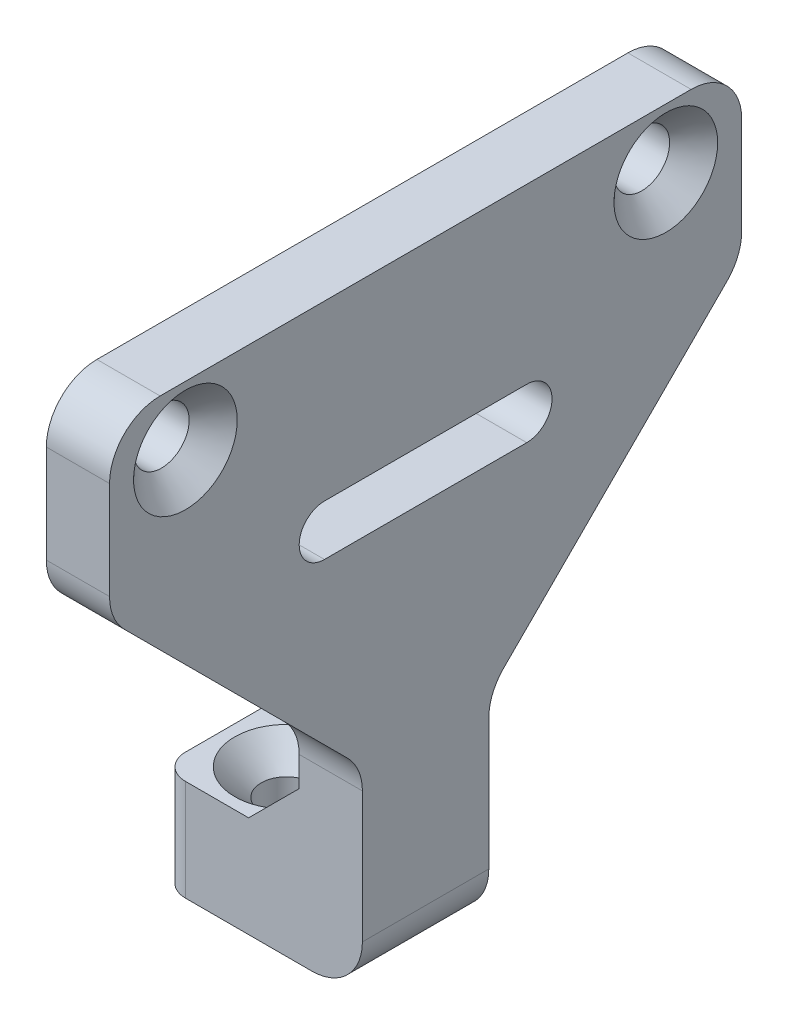
ISO-10303-21;
HEADER;
FILE_DESCRIPTION(('STEP AP214'),'2;1');
FILE_NAME('part.step','',(''),(''),'','','');
FILE_SCHEMA(('AUTOMOTIVE_DESIGN { 1 0 10303 214 1 1 1 1 }'));
ENDSEC;
DATA;
#1=APPLICATION_CONTEXT('core data for automotive mechanical design processes');
#2=APPLICATION_PROTOCOL_DEFINITION('international standard','automotive_design',2000,#1);
#3=PRODUCT_CONTEXT('',#1,'mechanical');
#4=PRODUCT('Part','Part','',(#3));
#5=PRODUCT_RELATED_PRODUCT_CATEGORY('part','',(#4));
#6=PRODUCT_DEFINITION_FORMATION('','',#4);
#7=PRODUCT_DEFINITION_CONTEXT('part definition',#1,'design');
#8=PRODUCT_DEFINITION('design','',#6,#7);
#9=PRODUCT_DEFINITION_SHAPE('','',#8);
#10=(LENGTH_UNIT() NAMED_UNIT(*) SI_UNIT(.MILLI.,.METRE.));
#11=(NAMED_UNIT(*) PLANE_ANGLE_UNIT() SI_UNIT($,.RADIAN.));
#12=(NAMED_UNIT(*) SI_UNIT($,.STERADIAN.) SOLID_ANGLE_UNIT());
#13=UNCERTAINTY_MEASURE_WITH_UNIT(LENGTH_MEASURE(1.E-05),#10,'distance_accuracy_value','');
#14=(GEOMETRIC_REPRESENTATION_CONTEXT(3) GLOBAL_UNCERTAINTY_ASSIGNED_CONTEXT((#13)) GLOBAL_UNIT_ASSIGNED_CONTEXT((#10,
#11,#12)) REPRESENTATION_CONTEXT('',''));
#15=CARTESIAN_POINT('',(0.,0.,0.));
#16=DIRECTION('',(0.,0.,1.));
#17=DIRECTION('',(1.,0.,0.));
#18=AXIS2_PLACEMENT_3D('',#15,#16,#17);
#19=CARTESIAN_POINT('',(0.,-16.35,2.5));
#20=DIRECTION('',(0.707106781186549,-0.707106781186546,0.));
#21=DIRECTION('',(0.707106781186546,0.707106781186549,0.));
#22=AXIS2_PLACEMENT_3D('',#19,#20,#21);
#23=PLANE('',#22);
#24=CARTESIAN_POINT('',(-3.,-19.35,0.));
#25=DIRECTION('',(0.707106781186549,-0.707106781186546,0.));
#26=DIRECTION('',(-0.707106781186546,-0.707106781186549,0.));
#27=AXIS2_PLACEMENT_3D('',#24,#25,#26);
#28=ELLIPSE('',#27,2.89913780286485,2.05);
#29=CARTESIAN_POINT('',(-1.99999999999999,-18.35,1.78955301681732));
#30=VERTEX_POINT('',#29);
#31=CARTESIAN_POINT('',(-1.99999999999999,-18.35,-1.78955301681732));
#32=VERTEX_POINT('',#31);
#33=EDGE_CURVE('E249',#30,#32,#28,.F.);
#34=ORIENTED_EDGE('',*,*,#33,.F.);
#35=DIRECTION('',(0.,0.,-1.));
#36=VECTOR('',#35,1.);
#37=CARTESIAN_POINT('',(-1.99999999999999,-18.35,2.5));
#38=LINE('',#37,#36);
#39=CARTESIAN_POINT('',(-1.99999999999999,-18.35,2.5));
#40=VERTEX_POINT('',#39);
#41=EDGE_CURVE('E285',#40,#30,#38,.T.);
#42=ORIENTED_EDGE('',*,*,#41,.F.);
#43=DIRECTION('',(-0.707106781186546,-0.707106781186549,0.));
#44=VECTOR('',#43,1.);
#45=CARTESIAN_POINT('',(0.,-16.35,2.5));
#46=LINE('',#45,#44);
#47=CARTESIAN_POINT('',(0.,-16.35,2.5));
#48=VERTEX_POINT('',#47);
#49=EDGE_CURVE('E259',#48,#40,#46,.T.);
#50=ORIENTED_EDGE('',*,*,#49,.F.);
#51=DIRECTION('',(0.,0.,-1.));
#52=VECTOR('',#51,1.);
#53=CARTESIAN_POINT('',(0.,-16.35,2.5));
#54=LINE('',#53,#52);
#55=CARTESIAN_POINT('',(0.,-16.35,-2.5));
#56=VERTEX_POINT('',#55);
#57=EDGE_CURVE('E288',#48,#56,#54,.T.);
#58=ORIENTED_EDGE('',*,*,#57,.T.);
#59=DIRECTION('',(-0.707106781186546,-0.707106781186549,0.));
#60=VECTOR('',#59,1.);
#61=CARTESIAN_POINT('',(0.,-16.35,-2.5));
#62=LINE('',#61,#60);
#63=CARTESIAN_POINT('',(-1.99999999999999,-18.35,-2.5));
#64=VERTEX_POINT('',#63);
#65=EDGE_CURVE('E268',#56,#64,#62,.T.);
#66=ORIENTED_EDGE('',*,*,#65,.T.);
#67=EDGE_CURVE('E284',#32,#64,#38,.T.);
#68=ORIENTED_EDGE('',*,*,#67,.F.);
#69=EDGE_LOOP('',(#34,#42,#50,#58,#66,#68));
#70=FACE_BOUND('',#69,.T.);
#71=ADVANCED_FACE('F35',(#70),#23,.F.);
#72=CARTESIAN_POINT('',(-1.99999999999999,-18.35,2.5));
#73=DIRECTION('',(0.,-1.,0.));
#74=DIRECTION('',(0.,0.,-1.));
#75=AXIS2_PLACEMENT_3D('',#72,#73,#74);
#76=PLANE('',#75);
#77=DIRECTION('',(-1.,0.,0.));
#78=VECTOR('',#77,1.);
#79=CARTESIAN_POINT('',(-1.99999999999999,-18.35,-2.5));
#80=LINE('',#79,#78);
#81=CARTESIAN_POINT('',(-4.5,-18.35,-2.5));
#82=VERTEX_POINT('',#81);
#83=EDGE_CURVE('E271',#64,#82,#80,.T.);
#84=ORIENTED_EDGE('',*,*,#83,.T.);
#85=CARTESIAN_POINT('',(-4.5,-18.35,-1.5));
#86=DIRECTION('',(0.,-1.,0.));
#87=DIRECTION('',(0.,0.,-1.));
#88=AXIS2_PLACEMENT_3D('',#85,#86,#87);
#89=CIRCLE('',#88,1.);
#90=CARTESIAN_POINT('',(-5.5,-18.35,-1.5));
#91=VERTEX_POINT('',#90);
#92=EDGE_CURVE('E389',#82,#91,#89,.F.);
#93=ORIENTED_EDGE('',*,*,#92,.T.);
#94=DIRECTION('',(0.,0.,-1.));
#95=VECTOR('',#94,1.);
#96=CARTESIAN_POINT('',(-5.5,-18.35,2.5));
#97=LINE('',#96,#95);
#98=CARTESIAN_POINT('',(-5.5,-18.35,1.5));
#99=VERTEX_POINT('',#98);
#100=EDGE_CURVE('E281',#99,#91,#97,.T.);
#101=ORIENTED_EDGE('',*,*,#100,.F.);
#102=CARTESIAN_POINT('',(-4.5,-18.35,1.5));
#103=DIRECTION('',(0.,-1.,0.));
#104=DIRECTION('',(0.,0.,-1.));
#105=AXIS2_PLACEMENT_3D('',#102,#103,#104);
#106=CIRCLE('',#105,1.);
#107=CARTESIAN_POINT('',(-4.5,-18.35,2.5));
#108=VERTEX_POINT('',#107);
#109=EDGE_CURVE('E387',#99,#108,#106,.F.);
#110=ORIENTED_EDGE('',*,*,#109,.T.);
#111=DIRECTION('',(-1.,0.,0.));
#112=VECTOR('',#111,1.);
#113=CARTESIAN_POINT('',(-1.99999999999999,-18.35,2.5));
#114=LINE('',#113,#112);
#115=EDGE_CURVE('E261',#40,#108,#114,.T.);
#116=ORIENTED_EDGE('',*,*,#115,.F.);
#117=ORIENTED_EDGE('',*,*,#41,.T.);
#118=CARTESIAN_POINT('',(-3.,-18.35,0.));
#119=DIRECTION('',(0.,1.,0.));
#120=DIRECTION('',(0.,0.,1.));
#121=AXIS2_PLACEMENT_3D('',#118,#119,#120);
#122=CIRCLE('',#121,2.05);
#123=EDGE_CURVE('E251',#32,#30,#122,.T.);
#124=ORIENTED_EDGE('',*,*,#123,.F.);
#125=ORIENTED_EDGE('',*,*,#67,.T.);
#126=EDGE_LOOP('',(#84,#93,#101,#110,#116,#117,#124,#125));
#127=FACE_BOUND('',#126,.T.);
#128=ADVANCED_FACE('F511',(#127),#76,.F.);
#129=CARTESIAN_POINT('',(2.5,0.,0.));
#130=DIRECTION('',(1.,0.,0.));
#131=DIRECTION('',(0.,0.,-1.));
#132=AXIS2_PLACEMENT_3D('',#129,#130,#131);
#133=PLANE('',#132);
#134=CARTESIAN_POINT('',(2.5,-5.5,4.));
#135=DIRECTION('',(1.,0.,0.));
#136=DIRECTION('',(0.,0.,-1.));
#137=AXIS2_PLACEMENT_3D('',#134,#135,#136);
#138=CIRCLE('',#137,1.);
#139=CARTESIAN_POINT('',(2.5,-4.5,4.));
#140=VERTEX_POINT('',#139);
#141=CARTESIAN_POINT('',(2.5,-6.5,4.));
#142=VERTEX_POINT('',#141);
#143=EDGE_CURVE('E223',#140,#142,#138,.T.);
#144=ORIENTED_EDGE('',*,*,#143,.F.);
#145=DIRECTION('',(0.,0.,1.));
#146=VECTOR('',#145,1.);
#147=CARTESIAN_POINT('',(2.5,-4.5,4.));
#148=LINE('',#147,#146);
#149=CARTESIAN_POINT('',(2.5,-4.5,-4.));
#150=VERTEX_POINT('',#149);
#151=EDGE_CURVE('E228',#150,#140,#148,.T.);
#152=ORIENTED_EDGE('',*,*,#151,.F.);
#153=CARTESIAN_POINT('',(2.5,-5.5,-4.));
#154=DIRECTION('',(1.,0.,0.));
#155=DIRECTION('',(0.,0.,-1.));
#156=AXIS2_PLACEMENT_3D('',#153,#154,#155);
#157=CIRCLE('',#156,1.);
#158=CARTESIAN_POINT('',(2.5,-6.5,-4.));
#159=VERTEX_POINT('',#158);
#160=EDGE_CURVE('E207',#159,#150,#157,.T.);
#161=ORIENTED_EDGE('',*,*,#160,.F.);
#162=DIRECTION('',(0.,0.,-1.));
#163=VECTOR('',#162,1.);
#164=CARTESIAN_POINT('',(2.5,-6.5,4.));
#165=LINE('',#164,#163);
#166=EDGE_CURVE('E218',#142,#159,#165,.T.);
#167=ORIENTED_EDGE('',*,*,#166,.F.);
#168=EDGE_LOOP('',(#144,#152,#161,#167));
#169=FACE_BOUND('',#168,.T.);
#170=DIRECTION('',(0.,1.,0.));
#171=VECTOR('',#170,1.);
#172=CARTESIAN_POINT('',(2.5,-2.35,2.5));
#173=LINE('',#172,#171);
#174=CARTESIAN_POINT('',(2.5,-20.35,2.5));
#175=VERTEX_POINT('',#174);
#176=CARTESIAN_POINT('',(2.5,-15.1784271247463,2.5));
#177=VERTEX_POINT('',#176);
#178=EDGE_CURVE('E267',#175,#177,#173,.T.);
#179=ORIENTED_EDGE('',*,*,#178,.F.);
#180=DIRECTION('',(0.,0.,-1.));
#181=VECTOR('',#180,1.);
#182=CARTESIAN_POINT('',(2.5,-20.35,-2.5));
#183=LINE('',#182,#181);
#184=CARTESIAN_POINT('',(2.5,-20.35,-2.5));
#185=VERTEX_POINT('',#184);
#186=EDGE_CURVE('E394',#175,#185,#183,.T.);
#187=ORIENTED_EDGE('',*,*,#186,.T.);
#188=DIRECTION('',(0.,1.,0.));
#189=VECTOR('',#188,1.);
#190=CARTESIAN_POINT('',(2.5,-2.35,-2.5));
#191=LINE('',#190,#189);
#192=CARTESIAN_POINT('',(2.5,-15.1784271247463,-2.5));
#193=VERTEX_POINT('',#192);
#194=EDGE_CURVE('E277',#185,#193,#191,.T.);
#195=ORIENTED_EDGE('',*,*,#194,.T.);
#196=CARTESIAN_POINT('',(2.5,-15.1784271247463,-4.5));
#197=DIRECTION('',(1.,0.,0.));
#198=DIRECTION('',(0.,0.,-1.));
#199=AXIS2_PLACEMENT_3D('',#196,#197,#198);
#200=CIRCLE('',#199,2.);
#201=CARTESIAN_POINT('',(2.5,-13.7642135623732,-3.0857864376269));
#202=VERTEX_POINT('',#201);
#203=EDGE_CURVE('E367',#193,#202,#200,.F.);
#204=ORIENTED_EDGE('',*,*,#203,.T.);
#205=DIRECTION('',(0.,0.707106781186551,-0.707106781186544));
#206=VECTOR('',#205,1.);
#207=CARTESIAN_POINT('',(2.5,-14.3500000000001,-2.5));
#208=LINE('',#207,#206);
#209=CARTESIAN_POINT('',(2.5,-4.9357864376269,-11.9142135623731));
#210=VERTEX_POINT('',#209);
#211=EDGE_CURVE('E235',#202,#210,#208,.T.);
#212=ORIENTED_EDGE('',*,*,#211,.T.);
#213=CARTESIAN_POINT('',(2.5,-3.52157287525382,-10.5));
#214=DIRECTION('',(1.,0.,0.));
#215=DIRECTION('',(0.,0.,-1.));
#216=AXIS2_PLACEMENT_3D('',#213,#214,#215);
#217=CIRCLE('',#216,2.);
#218=CARTESIAN_POINT('',(2.5,-3.52157287525382,-12.5));
#219=VERTEX_POINT('',#218);
#220=EDGE_CURVE('E422',#210,#219,#217,.T.);
#221=ORIENTED_EDGE('',*,*,#220,.T.);
#222=DIRECTION('',(0.,1.,0.));
#223=VECTOR('',#222,1.);
#224=CARTESIAN_POINT('',(2.5,2.35,-12.5));
#225=LINE('',#224,#223);
#226=CARTESIAN_POINT('',(2.5,0.35,-12.5));
#227=VERTEX_POINT('',#226);
#228=EDGE_CURVE('E309',#219,#227,#225,.T.);
#229=ORIENTED_EDGE('',*,*,#228,.T.);
#230=CARTESIAN_POINT('',(2.5,0.35,-10.5));
#231=DIRECTION('',(1.,0.,0.));
#232=DIRECTION('',(0.,0.,-1.));
#233=AXIS2_PLACEMENT_3D('',#230,#231,#232);
#234=CIRCLE('',#233,2.);
#235=CARTESIAN_POINT('',(2.5,2.35,-10.5));
#236=VERTEX_POINT('',#235);
#237=EDGE_CURVE('E418',#227,#236,#234,.T.);
#238=ORIENTED_EDGE('',*,*,#237,.T.);
#239=DIRECTION('',(0.,0.,1.));
#240=VECTOR('',#239,1.);
#241=CARTESIAN_POINT('',(2.5,2.35,12.5));
#242=LINE('',#241,#240);
#243=CARTESIAN_POINT('',(2.5,2.35,10.5));
#244=VERTEX_POINT('',#243);
#245=EDGE_CURVE('E313',#236,#244,#242,.T.);
#246=ORIENTED_EDGE('',*,*,#245,.T.);
#247=CARTESIAN_POINT('',(2.5,0.35,10.5));
#248=DIRECTION('',(1.,0.,0.));
#249=DIRECTION('',(0.,0.,-1.));
#250=AXIS2_PLACEMENT_3D('',#247,#248,#249);
#251=CIRCLE('',#250,2.);
#252=CARTESIAN_POINT('',(2.5,0.35,12.5));
#253=VERTEX_POINT('',#252);
#254=EDGE_CURVE('E416',#244,#253,#251,.T.);
#255=ORIENTED_EDGE('',*,*,#254,.T.);
#256=DIRECTION('',(0.,-1.,0.));
#257=VECTOR('',#256,1.);
#258=CARTESIAN_POINT('',(2.5,2.35,12.5));
#259=LINE('',#258,#257);
#260=CARTESIAN_POINT('',(2.5,-3.52157287525381,12.5));
#261=VERTEX_POINT('',#260);
#262=EDGE_CURVE('E306',#253,#261,#259,.T.);
#263=ORIENTED_EDGE('',*,*,#262,.T.);
#264=CARTESIAN_POINT('',(2.5,-3.52157287525381,10.5));
#265=DIRECTION('',(1.,0.,0.));
#266=DIRECTION('',(0.,0.,-1.));
#267=AXIS2_PLACEMENT_3D('',#264,#265,#266);
#268=CIRCLE('',#267,2.);
#269=CARTESIAN_POINT('',(2.5,-4.9357864376269,11.9142135623731));
#270=VERTEX_POINT('',#269);
#271=EDGE_CURVE('E420',#261,#270,#268,.T.);
#272=ORIENTED_EDGE('',*,*,#271,.T.);
#273=DIRECTION('',(0.,-0.707106781186551,-0.707106781186544));
#274=VECTOR('',#273,1.);
#275=CARTESIAN_POINT('',(2.5,-14.3500000000001,2.5));
#276=LINE('',#275,#274);
#277=CARTESIAN_POINT('',(2.5,-13.7642135623732,3.0857864376269));
#278=VERTEX_POINT('',#277);
#279=EDGE_CURVE('E241',#270,#278,#276,.T.);
#280=ORIENTED_EDGE('',*,*,#279,.T.);
#281=CARTESIAN_POINT('',(2.5,-15.1784271247463,4.5));
#282=DIRECTION('',(1.,0.,0.));
#283=DIRECTION('',(0.,0.,-1.));
#284=AXIS2_PLACEMENT_3D('',#281,#282,#283);
#285=CIRCLE('',#284,2.);
#286=EDGE_CURVE('E371',#278,#177,#285,.F.);
#287=ORIENTED_EDGE('',*,*,#286,.T.);
#288=EDGE_LOOP('',(#179,#187,#195,#204,#212,#221,#229,#238,#246,#255,#263,#272,#280,#287));
#289=FACE_BOUND('',#288,.T.);
#290=CARTESIAN_POINT('',(2.5,0.,9.5));
#291=DIRECTION('',(1.,0.,0.));
#292=DIRECTION('',(0.,0.,-1.));
#293=AXIS2_PLACEMENT_3D('',#290,#291,#292);
#294=CIRCLE('',#293,2.05);
#295=CARTESIAN_POINT('',(2.5,0.,7.45));
#296=VERTEX_POINT('',#295);
#297=EDGE_CURVE('E291',#296,#296,#294,.T.);
#298=ORIENTED_EDGE('',*,*,#297,.F.);
#299=EDGE_LOOP('',(#298));
#300=FACE_BOUND('',#299,.T.);
#301=CARTESIAN_POINT('',(2.5,0.,-9.5));
#302=DIRECTION('',(1.,0.,0.));
#303=DIRECTION('',(0.,0.,-1.));
#304=AXIS2_PLACEMENT_3D('',#301,#302,#303);
#305=CIRCLE('',#304,2.05);
#306=CARTESIAN_POINT('',(2.5,0.,-11.55));
#307=VERTEX_POINT('',#306);
#308=EDGE_CURVE('E295',#307,#307,#305,.T.);
#309=ORIENTED_EDGE('',*,*,#308,.F.);
#310=EDGE_LOOP('',(#309));
#311=FACE_BOUND('',#310,.T.);
#312=ADVANCED_FACE('F225',(#169,#289,#300,#311),#133,.T.);
#313=CARTESIAN_POINT('',(0.,0.,0.));
#314=DIRECTION('',(1.,0.,0.));
#315=DIRECTION('',(0.,0.,-1.));
#316=AXIS2_PLACEMENT_3D('',#313,#314,#315);
#317=PLANE('',#316);
#318=DIRECTION('',(0.,0.,1.));
#319=VECTOR('',#318,1.);
#320=CARTESIAN_POINT('',(0.,-4.5,0.));
#321=LINE('',#320,#319);
#322=CARTESIAN_POINT('',(0.,-4.5,-4.));
#323=VERTEX_POINT('',#322);
#324=CARTESIAN_POINT('',(0.,-4.5,4.));
#325=VERTEX_POINT('',#324);
#326=EDGE_CURVE('E405',#323,#325,#321,.T.);
#327=ORIENTED_EDGE('',*,*,#326,.T.);
#328=CARTESIAN_POINT('',(0.,-5.5,4.));
#329=DIRECTION('',(1.,0.,0.));
#330=DIRECTION('',(0.,0.,-1.));
#331=AXIS2_PLACEMENT_3D('',#328,#329,#330);
#332=CIRCLE('',#331,1.);
#333=CARTESIAN_POINT('',(0.,-6.5,4.));
#334=VERTEX_POINT('',#333);
#335=EDGE_CURVE('E408',#325,#334,#332,.T.);
#336=ORIENTED_EDGE('',*,*,#335,.T.);
#337=DIRECTION('',(0.,0.,-1.));
#338=VECTOR('',#337,1.);
#339=CARTESIAN_POINT('',(0.,-6.5,0.));
#340=LINE('',#339,#338);
#341=CARTESIAN_POINT('',(0.,-6.5,-4.));
#342=VERTEX_POINT('',#341);
#343=EDGE_CURVE('E316',#334,#342,#340,.T.);
#344=ORIENTED_EDGE('',*,*,#343,.T.);
#345=CARTESIAN_POINT('',(0.,-5.5,-4.));
#346=DIRECTION('',(1.,0.,0.));
#347=DIRECTION('',(0.,0.,-1.));
#348=AXIS2_PLACEMENT_3D('',#345,#346,#347);
#349=CIRCLE('',#348,1.);
#350=EDGE_CURVE('E210',#342,#323,#349,.T.);
#351=ORIENTED_EDGE('',*,*,#350,.T.);
#352=EDGE_LOOP('',(#327,#336,#344,#351));
#353=FACE_BOUND('',#352,.T.);
#354=DIRECTION('',(0.,1.,0.));
#355=VECTOR('',#354,1.);
#356=CARTESIAN_POINT('',(0.,2.35,-12.5));
#357=LINE('',#356,#355);
#358=CARTESIAN_POINT('',(0.,-3.52157287525382,-12.5));
#359=VERTEX_POINT('',#358);
#360=CARTESIAN_POINT('',(0.,0.35,-12.5));
#361=VERTEX_POINT('',#360);
#362=EDGE_CURVE('E319',#359,#361,#357,.T.);
#363=ORIENTED_EDGE('',*,*,#362,.F.);
#364=CARTESIAN_POINT('',(0.,-3.52157287525382,-10.5));
#365=DIRECTION('',(1.,0.,0.));
#366=DIRECTION('',(0.,0.,-1.));
#367=AXIS2_PLACEMENT_3D('',#364,#365,#366);
#368=CIRCLE('',#367,2.);
#369=CARTESIAN_POINT('',(0.,-4.9357864376269,-11.9142135623731));
#370=VERTEX_POINT('',#369);
#371=EDGE_CURVE('E344',#359,#370,#368,.F.);
#372=ORIENTED_EDGE('',*,*,#371,.T.);
#373=DIRECTION('',(0.,-0.707106781186551,0.707106781186544));
#374=VECTOR('',#373,1.);
#375=CARTESIAN_POINT('',(0.,-14.3500000000001,-2.5));
#376=LINE('',#375,#374);
#377=CARTESIAN_POINT('',(0.,-13.7642135623732,-3.0857864376269));
#378=VERTEX_POINT('',#377);
#379=EDGE_CURVE('E238',#370,#378,#376,.T.);
#380=ORIENTED_EDGE('',*,*,#379,.T.);
#381=CARTESIAN_POINT('',(0.,-15.1784271247463,-4.5));
#382=DIRECTION('',(1.,0.,0.));
#383=DIRECTION('',(0.,0.,-1.));
#384=AXIS2_PLACEMENT_3D('',#381,#382,#383);
#385=CIRCLE('',#384,2.);
#386=CARTESIAN_POINT('',(0.,-15.1784271247463,-2.5));
#387=VERTEX_POINT('',#386);
#388=EDGE_CURVE('E369',#378,#387,#385,.T.);
#389=ORIENTED_EDGE('',*,*,#388,.T.);
#390=DIRECTION('',(0.,-1.,0.));
#391=VECTOR('',#390,1.);
#392=CARTESIAN_POINT('',(0.,-2.35,-2.5));
#393=LINE('',#392,#391);
#394=EDGE_CURVE('E272',#387,#56,#393,.T.);
#395=ORIENTED_EDGE('',*,*,#394,.T.);
#396=ORIENTED_EDGE('',*,*,#57,.F.);
#397=DIRECTION('',(0.,-1.,0.));
#398=VECTOR('',#397,1.);
#399=CARTESIAN_POINT('',(0.,-2.35,2.5));
#400=LINE('',#399,#398);
#401=CARTESIAN_POINT('',(0.,-15.1784271247463,2.5));
#402=VERTEX_POINT('',#401);
#403=EDGE_CURVE('E262',#402,#48,#400,.T.);
#404=ORIENTED_EDGE('',*,*,#403,.F.);
#405=CARTESIAN_POINT('',(0.,-15.1784271247463,4.5));
#406=DIRECTION('',(1.,0.,0.));
#407=DIRECTION('',(0.,0.,-1.));
#408=AXIS2_PLACEMENT_3D('',#405,#406,#407);
#409=CIRCLE('',#408,2.);
#410=CARTESIAN_POINT('',(0.,-13.7642135623732,3.0857864376269));
#411=VERTEX_POINT('',#410);
#412=EDGE_CURVE('E374',#402,#411,#409,.T.);
#413=ORIENTED_EDGE('',*,*,#412,.T.);
#414=DIRECTION('',(0.,0.707106781186551,0.707106781186544));
#415=VECTOR('',#414,1.);
#416=CARTESIAN_POINT('',(0.,-14.3500000000001,2.5));
#417=LINE('',#416,#415);
#418=CARTESIAN_POINT('',(0.,-4.9357864376269,11.9142135623731));
#419=VERTEX_POINT('',#418);
#420=EDGE_CURVE('E246',#411,#419,#417,.T.);
#421=ORIENTED_EDGE('',*,*,#420,.T.);
#422=CARTESIAN_POINT('',(0.,-3.52157287525381,10.5));
#423=DIRECTION('',(1.,0.,0.));
#424=DIRECTION('',(0.,0.,-1.));
#425=AXIS2_PLACEMENT_3D('',#422,#423,#424);
#426=CIRCLE('',#425,2.);
#427=CARTESIAN_POINT('',(0.,-3.52157287525381,12.5));
#428=VERTEX_POINT('',#427);
#429=EDGE_CURVE('E342',#419,#428,#426,.F.);
#430=ORIENTED_EDGE('',*,*,#429,.T.);
#431=DIRECTION('',(0.,-1.,0.));
#432=VECTOR('',#431,1.);
#433=CARTESIAN_POINT('',(0.,2.35,12.5));
#434=LINE('',#433,#432);
#435=CARTESIAN_POINT('',(0.,0.35,12.5));
#436=VERTEX_POINT('',#435);
#437=EDGE_CURVE('E305',#436,#428,#434,.T.);
#438=ORIENTED_EDGE('',*,*,#437,.F.);
#439=CARTESIAN_POINT('',(0.,0.35,10.5));
#440=DIRECTION('',(1.,0.,0.));
#441=DIRECTION('',(0.,0.,-1.));
#442=AXIS2_PLACEMENT_3D('',#439,#440,#441);
#443=CIRCLE('',#442,2.);
#444=CARTESIAN_POINT('',(0.,2.35,10.5));
#445=VERTEX_POINT('',#444);
#446=EDGE_CURVE('E337',#436,#445,#443,.F.);
#447=ORIENTED_EDGE('',*,*,#446,.T.);
#448=DIRECTION('',(0.,0.,1.));
#449=VECTOR('',#448,1.);
#450=CARTESIAN_POINT('',(0.,2.35,12.5));
#451=LINE('',#450,#449);
#452=CARTESIAN_POINT('',(0.,2.35,-10.5));
#453=VERTEX_POINT('',#452);
#454=EDGE_CURVE('E310',#453,#445,#451,.T.);
#455=ORIENTED_EDGE('',*,*,#454,.F.);
#456=CARTESIAN_POINT('',(0.,0.35,-10.5));
#457=DIRECTION('',(1.,0.,0.));
#458=DIRECTION('',(0.,0.,-1.));
#459=AXIS2_PLACEMENT_3D('',#456,#457,#458);
#460=CIRCLE('',#459,2.);
#461=EDGE_CURVE('E339',#453,#361,#460,.F.);
#462=ORIENTED_EDGE('',*,*,#461,.T.);
#463=EDGE_LOOP('',(#363,#372,#380,#389,#395,#396,#404,#413,#421,#430,#438,#447,#455,#462));
#464=FACE_BOUND('',#463,.T.);
#465=CARTESIAN_POINT('',(0.,0.,-9.5));
#466=DIRECTION('',(1.,0.,0.));
#467=DIRECTION('',(0.,0.,-1.));
#468=AXIS2_PLACEMENT_3D('',#465,#466,#467);
#469=CIRCLE('',#468,1.1);
#470=CARTESIAN_POINT('',(0.,0.,-10.6));
#471=VERTEX_POINT('',#470);
#472=EDGE_CURVE('E302',#471,#471,#469,.T.);
#473=ORIENTED_EDGE('',*,*,#472,.T.);
#474=EDGE_LOOP('',(#473));
#475=FACE_BOUND('',#474,.T.);
#476=CARTESIAN_POINT('',(0.,0.,9.5));
#477=DIRECTION('',(1.,0.,0.));
#478=DIRECTION('',(0.,0.,-1.));
#479=AXIS2_PLACEMENT_3D('',#476,#477,#478);
#480=CIRCLE('',#479,1.1);
#481=CARTESIAN_POINT('',(0.,0.,8.4));
#482=VERTEX_POINT('',#481);
#483=EDGE_CURVE('E299',#482,#482,#480,.T.);
#484=ORIENTED_EDGE('',*,*,#483,.T.);
#485=EDGE_LOOP('',(#484));
#486=FACE_BOUND('',#485,.T.);
#487=ADVANCED_FACE('F434',(#353,#464,#475,#486),#317,.F.);
#488=CARTESIAN_POINT('',(2.5,2.35,12.5));
#489=DIRECTION('',(0.,0.,-1.));
#490=DIRECTION('',(-1.,0.,0.));
#491=AXIS2_PLACEMENT_3D('',#488,#489,#490);
#492=PLANE('',#491);
#493=ORIENTED_EDGE('',*,*,#437,.T.);
#494=DIRECTION('',(1.,0.,0.));
#495=VECTOR('',#494,1.);
#496=CARTESIAN_POINT('',(2.5,-3.52157287525381,12.5));
#497=LINE('',#496,#495);
#498=EDGE_CURVE('E359',#428,#261,#497,.T.);
#499=ORIENTED_EDGE('',*,*,#498,.T.);
#500=ORIENTED_EDGE('',*,*,#262,.F.);
#501=DIRECTION('',(-1.,0.,0.));
#502=VECTOR('',#501,1.);
#503=CARTESIAN_POINT('',(2.5,0.35,12.5));
#504=LINE('',#503,#502);
#505=EDGE_CURVE('E356',#253,#436,#504,.T.);
#506=ORIENTED_EDGE('',*,*,#505,.T.);
#507=EDGE_LOOP('',(#493,#499,#500,#506));
#508=FACE_BOUND('',#507,.T.);
#509=ADVANCED_FACE('F483',(#508),#492,.F.);
#510=CARTESIAN_POINT('',(2.5,2.35,-12.5));
#511=DIRECTION('',(0.,0.,1.));
#512=DIRECTION('',(1.,0.,0.));
#513=AXIS2_PLACEMENT_3D('',#510,#511,#512);
#514=PLANE('',#513);
#515=ORIENTED_EDGE('',*,*,#228,.F.);
#516=DIRECTION('',(1.,0.,0.));
#517=VECTOR('',#516,1.);
#518=CARTESIAN_POINT('',(0.,-3.52157287525382,-12.5));
#519=LINE('',#518,#517);
#520=EDGE_CURVE('E340',#219,#359,#519,.F.);
#521=ORIENTED_EDGE('',*,*,#520,.T.);
#522=ORIENTED_EDGE('',*,*,#362,.T.);
#523=DIRECTION('',(-1.,0.,0.));
#524=VECTOR('',#523,1.);
#525=CARTESIAN_POINT('',(2.5,0.35,-12.5));
#526=LINE('',#525,#524);
#527=EDGE_CURVE('E424',#361,#227,#526,.F.);
#528=ORIENTED_EDGE('',*,*,#527,.T.);
#529=EDGE_LOOP('',(#515,#521,#522,#528));
#530=FACE_BOUND('',#529,.T.);
#531=ADVANCED_FACE('F429',(#530),#514,.F.);
#532=CARTESIAN_POINT('',(2.5,2.35,12.5));
#533=DIRECTION('',(0.,-1.,0.));
#534=DIRECTION('',(0.,0.,-1.));
#535=AXIS2_PLACEMENT_3D('',#532,#533,#534);
#536=PLANE('',#535);
#537=ORIENTED_EDGE('',*,*,#245,.F.);
#538=DIRECTION('',(-1.,0.,0.));
#539=VECTOR('',#538,1.);
#540=CARTESIAN_POINT('',(2.5,2.35,-10.5));
#541=LINE('',#540,#539);
#542=EDGE_CURVE('E364',#236,#453,#541,.T.);
#543=ORIENTED_EDGE('',*,*,#542,.T.);
#544=ORIENTED_EDGE('',*,*,#454,.T.);
#545=DIRECTION('',(-1.,0.,0.));
#546=VECTOR('',#545,1.);
#547=CARTESIAN_POINT('',(2.5,2.35,10.5));
#548=LINE('',#547,#546);
#549=EDGE_CURVE('E362',#445,#244,#548,.F.);
#550=ORIENTED_EDGE('',*,*,#549,.T.);
#551=EDGE_LOOP('',(#537,#543,#544,#550));
#552=FACE_BOUND('',#551,.T.);
#553=ADVANCED_FACE('F492',(#552),#536,.F.);
#554=CARTESIAN_POINT('',(2.5,0.,-9.5));
#555=DIRECTION('',(-1.,0.,0.));
#556=DIRECTION('',(0.,0.,1.));
#557=AXIS2_PLACEMENT_3D('',#554,#555,#556);
#558=CYLINDRICAL_SURFACE('',#557,1.1);
#559=CARTESIAN_POINT('',(1.55,0.,-9.5));
#560=DIRECTION('',(1.,0.,0.));
#561=DIRECTION('',(0.,0.,-1.));
#562=AXIS2_PLACEMENT_3D('',#559,#560,#561);
#563=CIRCLE('',#562,1.1);
#564=CARTESIAN_POINT('',(1.55,0.,-10.6));
#565=VERTEX_POINT('',#564);
#566=EDGE_CURVE('E298',#565,#565,#563,.F.);
#567=ORIENTED_EDGE('',*,*,#566,.F.);
#568=EDGE_LOOP('',(#567));
#569=FACE_BOUND('',#568,.T.);
#570=ORIENTED_EDGE('',*,*,#472,.F.);
#571=EDGE_LOOP('',(#570));
#572=FACE_BOUND('',#571,.T.);
#573=ADVANCED_FACE('F551',(#569,#572),#558,.F.);
#574=CARTESIAN_POINT('',(2.5,0.,9.5));
#575=DIRECTION('',(-1.,0.,0.));
#576=DIRECTION('',(0.,0.,1.));
#577=AXIS2_PLACEMENT_3D('',#574,#575,#576);
#578=CYLINDRICAL_SURFACE('',#577,1.1);
#579=CARTESIAN_POINT('',(1.55,0.,9.5));
#580=DIRECTION('',(1.,0.,0.));
#581=DIRECTION('',(0.,0.,-1.));
#582=AXIS2_PLACEMENT_3D('',#579,#580,#581);
#583=CIRCLE('',#582,1.1);
#584=CARTESIAN_POINT('',(1.55,0.,8.4));
#585=VERTEX_POINT('',#584);
#586=EDGE_CURVE('E294',#585,#585,#583,.F.);
#587=ORIENTED_EDGE('',*,*,#586,.F.);
#588=EDGE_LOOP('',(#587));
#589=FACE_BOUND('',#588,.T.);
#590=ORIENTED_EDGE('',*,*,#483,.F.);
#591=EDGE_LOOP('',(#590));
#592=FACE_BOUND('',#591,.T.);
#593=ADVANCED_FACE('F547',(#589,#592),#578,.F.);
#594=CARTESIAN_POINT('',(2.5,0.,-9.5));
#595=DIRECTION('',(1.,0.,0.));
#596=DIRECTION('',(0.,0.,-1.));
#597=AXIS2_PLACEMENT_3D('',#594,#595,#596);
#598=CONICAL_SURFACE('',#597,2.05,0.78539816339745);
#599=ORIENTED_EDGE('',*,*,#566,.T.);
#600=EDGE_LOOP('',(#599));
#601=FACE_BOUND('',#600,.T.);
#602=ORIENTED_EDGE('',*,*,#308,.T.);
#603=EDGE_LOOP('',(#602));
#604=FACE_BOUND('',#603,.T.);
#605=ADVANCED_FACE('F543',(#601,#604),#598,.F.);
#606=CARTESIAN_POINT('',(2.5,0.,9.5));
#607=DIRECTION('',(1.,0.,0.));
#608=DIRECTION('',(0.,0.,-1.));
#609=AXIS2_PLACEMENT_3D('',#606,#607,#608);
#610=CONICAL_SURFACE('',#609,2.05,0.78539816339745);
#611=ORIENTED_EDGE('',*,*,#586,.T.);
#612=EDGE_LOOP('',(#611));
#613=FACE_BOUND('',#612,.T.);
#614=ORIENTED_EDGE('',*,*,#297,.T.);
#615=EDGE_LOOP('',(#614));
#616=FACE_BOUND('',#615,.T.);
#617=ADVANCED_FACE('F540',(#613,#616),#610,.F.);
#618=CARTESIAN_POINT('',(-5.5,-18.35,2.5));
#619=DIRECTION('',(1.,0.,0.));
#620=DIRECTION('',(0.,1.,0.));
#621=AXIS2_PLACEMENT_3D('',#618,#619,#620);
#622=PLANE('',#621);
#623=ORIENTED_EDGE('',*,*,#100,.T.);
#624=DIRECTION('',(0.,-1.,0.));
#625=VECTOR('',#624,1.);
#626=CARTESIAN_POINT('',(-5.5,-22.35,-1.5));
#627=LINE('',#626,#625);
#628=CARTESIAN_POINT('',(-5.5,-22.35,-1.5));
#629=VERTEX_POINT('',#628);
#630=EDGE_CURVE('E378',#91,#629,#627,.T.);
#631=ORIENTED_EDGE('',*,*,#630,.T.);
#632=DIRECTION('',(0.,0.,-1.));
#633=VECTOR('',#632,1.);
#634=CARTESIAN_POINT('',(-5.5,-22.35,2.5));
#635=LINE('',#634,#633);
#636=CARTESIAN_POINT('',(-5.5,-22.35,1.5));
#637=VERTEX_POINT('',#636);
#638=EDGE_CURVE('E278',#637,#629,#635,.T.);
#639=ORIENTED_EDGE('',*,*,#638,.F.);
#640=DIRECTION('',(0.,-1.,0.));
#641=VECTOR('',#640,1.);
#642=CARTESIAN_POINT('',(-5.5,-18.35,1.5));
#643=LINE('',#642,#641);
#644=EDGE_CURVE('E376',#637,#99,#643,.F.);
#645=ORIENTED_EDGE('',*,*,#644,.T.);
#646=EDGE_LOOP('',(#623,#631,#639,#645));
#647=FACE_BOUND('',#646,.T.);
#648=ADVANCED_FACE('F505',(#647),#622,.F.);
#649=CARTESIAN_POINT('',(-5.5,-22.35,2.5));
#650=DIRECTION('',(0.,1.,0.));
#651=DIRECTION('',(0.,0.,1.));
#652=AXIS2_PLACEMENT_3D('',#649,#650,#651);
#653=PLANE('',#652);
#654=CARTESIAN_POINT('',(-3.,-22.35,0.));
#655=DIRECTION('',(0.,1.,0.));
#656=DIRECTION('',(0.,0.,1.));
#657=AXIS2_PLACEMENT_3D('',#654,#655,#656);
#658=CIRCLE('',#657,0.999999999999999);
#659=CARTESIAN_POINT('',(-3.,-22.35,0.999999999999999));
#660=VERTEX_POINT('',#659);
#661=EDGE_CURVE('E258',#660,#660,#658,.T.);
#662=ORIENTED_EDGE('',*,*,#661,.T.);
#663=EDGE_LOOP('',(#662));
#664=FACE_BOUND('',#663,.T.);
#665=DIRECTION('',(1.,0.,0.));
#666=VECTOR('',#665,1.);
#667=CARTESIAN_POINT('',(-5.5,-22.35,-2.5));
#668=LINE('',#667,#666);
#669=CARTESIAN_POINT('',(-4.5,-22.35,-2.5));
#670=VERTEX_POINT('',#669);
#671=CARTESIAN_POINT('',(0.5,-22.35,-2.5));
#672=VERTEX_POINT('',#671);
#673=EDGE_CURVE('E275',#670,#672,#668,.T.);
#674=ORIENTED_EDGE('',*,*,#673,.T.);
#675=DIRECTION('',(0.,0.,-1.));
#676=VECTOR('',#675,1.);
#677=CARTESIAN_POINT('',(0.5,-22.35,2.5));
#678=LINE('',#677,#676);
#679=CARTESIAN_POINT('',(0.5,-22.35,2.5));
#680=VERTEX_POINT('',#679);
#681=EDGE_CURVE('E43',#672,#680,#678,.F.);
#682=ORIENTED_EDGE('',*,*,#681,.T.);
#683=DIRECTION('',(1.,0.,0.));
#684=VECTOR('',#683,1.);
#685=CARTESIAN_POINT('',(-5.5,-22.35,2.5));
#686=LINE('',#685,#684);
#687=CARTESIAN_POINT('',(-4.5,-22.35,2.5));
#688=VERTEX_POINT('',#687);
#689=EDGE_CURVE('E265',#688,#680,#686,.T.);
#690=ORIENTED_EDGE('',*,*,#689,.F.);
#691=CARTESIAN_POINT('',(-4.5,-22.35,1.5));
#692=DIRECTION('',(0.,1.,0.));
#693=DIRECTION('',(0.,0.,1.));
#694=AXIS2_PLACEMENT_3D('',#691,#692,#693);
#695=CIRCLE('',#694,1.);
#696=EDGE_CURVE('E381',#688,#637,#695,.F.);
#697=ORIENTED_EDGE('',*,*,#696,.T.);
#698=ORIENTED_EDGE('',*,*,#638,.T.);
#699=CARTESIAN_POINT('',(-4.5,-22.35,-1.5));
#700=DIRECTION('',(0.,1.,0.));
#701=DIRECTION('',(0.,0.,1.));
#702=AXIS2_PLACEMENT_3D('',#699,#700,#701);
#703=CIRCLE('',#702,1.);
#704=EDGE_CURVE('E383',#629,#670,#703,.F.);
#705=ORIENTED_EDGE('',*,*,#704,.T.);
#706=EDGE_LOOP('',(#674,#682,#690,#697,#698,#705));
#707=FACE_BOUND('',#706,.T.);
#708=ADVANCED_FACE('F500',(#664,#707),#653,.F.);
#709=CARTESIAN_POINT('',(0.,0.,2.5));
#710=DIRECTION('',(0.,0.,-1.));
#711=DIRECTION('',(-1.,0.,0.));
#712=AXIS2_PLACEMENT_3D('',#709,#710,#711);
#713=PLANE('',#712);
#714=ORIENTED_EDGE('',*,*,#689,.T.);
#715=CARTESIAN_POINT('',(0.5,-20.35,2.5));
#716=DIRECTION('',(0.,0.,-1.));
#717=DIRECTION('',(-1.,0.,0.));
#718=AXIS2_PLACEMENT_3D('',#715,#716,#717);
#719=CIRCLE('',#718,2.);
#720=EDGE_CURVE('E11',#680,#175,#719,.F.);
#721=ORIENTED_EDGE('',*,*,#720,.T.);
#722=ORIENTED_EDGE('',*,*,#178,.T.);
#723=DIRECTION('',(1.,0.,0.));
#724=VECTOR('',#723,1.);
#725=CARTESIAN_POINT('',(0.,-15.1784271247463,2.5));
#726=LINE('',#725,#724);
#727=EDGE_CURVE('E354',#177,#402,#726,.F.);
#728=ORIENTED_EDGE('',*,*,#727,.T.);
#729=ORIENTED_EDGE('',*,*,#403,.T.);
#730=ORIENTED_EDGE('',*,*,#49,.T.);
#731=ORIENTED_EDGE('',*,*,#115,.T.);
#732=DIRECTION('',(0.,-1.,0.));
#733=VECTOR('',#732,1.);
#734=CARTESIAN_POINT('',(-4.5,0.,2.5));
#735=LINE('',#734,#733);
#736=EDGE_CURVE('E391',#108,#688,#735,.T.);
#737=ORIENTED_EDGE('',*,*,#736,.T.);
#738=EDGE_LOOP('',(#714,#721,#722,#728,#729,#730,#731,#737));
#739=FACE_BOUND('',#738,.T.);
#740=ADVANCED_FACE('F466',(#739),#713,.F.);
#741=CARTESIAN_POINT('',(0.,0.,-2.5));
#742=DIRECTION('',(0.,0.,-1.));
#743=DIRECTION('',(-1.,0.,0.));
#744=AXIS2_PLACEMENT_3D('',#741,#742,#743);
#745=PLANE('',#744);
#746=ORIENTED_EDGE('',*,*,#194,.F.);
#747=CARTESIAN_POINT('',(0.5,-20.35,-2.5));
#748=DIRECTION('',(0.,0.,-1.));
#749=DIRECTION('',(-1.,0.,0.));
#750=AXIS2_PLACEMENT_3D('',#747,#748,#749);
#751=CIRCLE('',#750,2.);
#752=EDGE_CURVE('E57',#185,#672,#751,.T.);
#753=ORIENTED_EDGE('',*,*,#752,.T.);
#754=ORIENTED_EDGE('',*,*,#673,.F.);
#755=DIRECTION('',(0.,-1.,0.));
#756=VECTOR('',#755,1.);
#757=CARTESIAN_POINT('',(-4.5,-18.35,-2.5));
#758=LINE('',#757,#756);
#759=EDGE_CURVE('E385',#670,#82,#758,.F.);
#760=ORIENTED_EDGE('',*,*,#759,.T.);
#761=ORIENTED_EDGE('',*,*,#83,.F.);
#762=ORIENTED_EDGE('',*,*,#65,.F.);
#763=ORIENTED_EDGE('',*,*,#394,.F.);
#764=DIRECTION('',(1.,0.,0.));
#765=VECTOR('',#764,1.);
#766=CARTESIAN_POINT('',(2.5,-15.1784271247463,-2.5));
#767=LINE('',#766,#765);
#768=EDGE_CURVE('E346',#387,#193,#767,.T.);
#769=ORIENTED_EDGE('',*,*,#768,.T.);
#770=EDGE_LOOP('',(#746,#753,#754,#760,#761,#762,#763,#769));
#771=FACE_BOUND('',#770,.T.);
#772=ADVANCED_FACE('F453',(#771),#745,.T.);
#773=CARTESIAN_POINT('',(-3.,-18.35,0.));
#774=DIRECTION('',(0.,1.,0.));
#775=DIRECTION('',(0.,0.,1.));
#776=AXIS2_PLACEMENT_3D('',#773,#774,#775);
#777=CYLINDRICAL_SURFACE('',#776,0.999999999999999);
#778=CARTESIAN_POINT('',(-3.,-19.4,0.));
#779=DIRECTION('',(0.,1.,0.));
#780=DIRECTION('',(0.,0.,1.));
#781=AXIS2_PLACEMENT_3D('',#778,#779,#780);
#782=CIRCLE('',#781,1.);
#783=CARTESIAN_POINT('',(-3.,-19.4,1.));
#784=VERTEX_POINT('',#783);
#785=EDGE_CURVE('E255',#784,#784,#782,.T.);
#786=ORIENTED_EDGE('',*,*,#785,.T.);
#787=EDGE_LOOP('',(#786));
#788=FACE_BOUND('',#787,.T.);
#789=ORIENTED_EDGE('',*,*,#661,.F.);
#790=EDGE_LOOP('',(#789));
#791=FACE_BOUND('',#790,.T.);
#792=ADVANCED_FACE('F529',(#788,#791),#777,.F.);
#793=CARTESIAN_POINT('',(-3.,-18.35,0.));
#794=DIRECTION('',(0.,1.,0.));
#795=DIRECTION('',(0.,0.,1.));
#796=AXIS2_PLACEMENT_3D('',#793,#794,#795);
#797=CONICAL_SURFACE('',#796,2.05,0.785398163397447);
#798=ORIENTED_EDGE('',*,*,#785,.F.);
#799=EDGE_LOOP('',(#798));
#800=FACE_BOUND('',#799,.T.);
#801=EDGE_CURVE('E252',#30,#32,#122,.T.);
#802=ORIENTED_EDGE('',*,*,#801,.T.);
#803=ORIENTED_EDGE('',*,*,#123,.T.);
#804=EDGE_LOOP('',(#802,#803));
#805=FACE_BOUND('',#804,.T.);
#806=ADVANCED_FACE('F520',(#800,#805),#797,.F.);
#807=CARTESIAN_POINT('',(-3.,-8.35,0.));
#808=DIRECTION('',(0.,-1.,0.));
#809=DIRECTION('',(0.,0.,-1.));
#810=AXIS2_PLACEMENT_3D('',#807,#808,#809);
#811=CYLINDRICAL_SURFACE('',#810,2.05);
#812=ORIENTED_EDGE('',*,*,#33,.T.);
#813=ORIENTED_EDGE('',*,*,#801,.F.);
#814=EDGE_LOOP('',(#812,#813));
#815=FACE_BOUND('',#814,.T.);
#816=ADVANCED_FACE('F521',(#815),#811,.F.);
#817=CARTESIAN_POINT('',(-15.6204993518134,-14.3500000000001,2.5));
#818=DIRECTION('',(0.,-0.707106781186544,0.707106781186551));
#819=DIRECTION('',(0.,-0.707106781186551,-0.707106781186544));
#820=AXIS2_PLACEMENT_3D('',#817,#818,#819);
#821=PLANE('',#820);
#822=ORIENTED_EDGE('',*,*,#420,.F.);
#823=DIRECTION('',(1.,0.,0.));
#824=VECTOR('',#823,1.);
#825=CARTESIAN_POINT('',(-15.6204993518134,-13.7642135623732,3.0857864376269));
#826=LINE('',#825,#824);
#827=EDGE_CURVE('E351',#411,#278,#826,.T.);
#828=ORIENTED_EDGE('',*,*,#827,.T.);
#829=ORIENTED_EDGE('',*,*,#279,.F.);
#830=DIRECTION('',(1.,0.,0.));
#831=VECTOR('',#830,1.);
#832=CARTESIAN_POINT('',(0.,-4.9357864376269,11.9142135623731));
#833=LINE('',#832,#831);
#834=EDGE_CURVE('E349',#270,#419,#833,.F.);
#835=ORIENTED_EDGE('',*,*,#834,.T.);
#836=EDGE_LOOP('',(#822,#828,#829,#835));
#837=FACE_BOUND('',#836,.T.);
#838=ADVANCED_FACE('F475',(#837),#821,.T.);
#839=CARTESIAN_POINT('',(-15.6204993518134,-14.3500000000001,-2.5));
#840=DIRECTION('',(0.,-0.707106781186544,-0.707106781186551));
#841=DIRECTION('',(0.,0.707106781186551,-0.707106781186544));
#842=AXIS2_PLACEMENT_3D('',#839,#840,#841);
#843=PLANE('',#842);
#844=ORIENTED_EDGE('',*,*,#379,.F.);
#845=DIRECTION('',(1.,0.,0.));
#846=VECTOR('',#845,1.);
#847=CARTESIAN_POINT('',(2.5,-4.9357864376269,-11.9142135623731));
#848=LINE('',#847,#846);
#849=EDGE_CURVE('E413',#370,#210,#848,.T.);
#850=ORIENTED_EDGE('',*,*,#849,.T.);
#851=ORIENTED_EDGE('',*,*,#211,.F.);
#852=DIRECTION('',(1.,0.,0.));
#853=VECTOR('',#852,1.);
#854=CARTESIAN_POINT('',(0.,-13.7642135623732,-3.0857864376269));
#855=LINE('',#854,#853);
#856=EDGE_CURVE('E411',#202,#378,#855,.F.);
#857=ORIENTED_EDGE('',*,*,#856,.T.);
#858=EDGE_LOOP('',(#844,#850,#851,#857));
#859=FACE_BOUND('',#858,.T.);
#860=ADVANCED_FACE('F442',(#859),#843,.T.);
#861=CARTESIAN_POINT('',(-7.5,-5.5,4.));
#862=DIRECTION('',(1.,0.,0.));
#863=DIRECTION('',(0.,0.,-1.));
#864=AXIS2_PLACEMENT_3D('',#861,#862,#863);
#865=CYLINDRICAL_SURFACE('',#864,1.);
#866=DIRECTION('',(1.,0.,0.));
#867=VECTOR('',#866,1.);
#868=CARTESIAN_POINT('',(-7.5,-4.5,4.));
#869=LINE('',#868,#867);
#870=EDGE_CURVE('E233',#325,#140,#869,.T.);
#871=ORIENTED_EDGE('',*,*,#870,.T.);
#872=ORIENTED_EDGE('',*,*,#143,.T.);
#873=DIRECTION('',(1.,0.,0.));
#874=VECTOR('',#873,1.);
#875=CARTESIAN_POINT('',(-7.5,-6.5,4.));
#876=LINE('',#875,#874);
#877=EDGE_CURVE('E214',#334,#142,#876,.T.);
#878=ORIENTED_EDGE('',*,*,#877,.F.);
#879=ORIENTED_EDGE('',*,*,#335,.F.);
#880=EDGE_LOOP('',(#871,#872,#878,#879));
#881=FACE_BOUND('',#880,.T.);
#882=ADVANCED_FACE('F692',(#881),#865,.F.);
#883=CARTESIAN_POINT('',(-7.5,-4.5,4.));
#884=DIRECTION('',(0.,1.,0.));
#885=DIRECTION('',(0.,0.,1.));
#886=AXIS2_PLACEMENT_3D('',#883,#884,#885);
#887=PLANE('',#886);
#888=DIRECTION('',(1.,0.,0.));
#889=VECTOR('',#888,1.);
#890=CARTESIAN_POINT('',(-7.5,-4.5,-4.));
#891=LINE('',#890,#889);
#892=EDGE_CURVE('E213',#323,#150,#891,.T.);
#893=ORIENTED_EDGE('',*,*,#892,.T.);
#894=ORIENTED_EDGE('',*,*,#151,.T.);
#895=ORIENTED_EDGE('',*,*,#870,.F.);
#896=ORIENTED_EDGE('',*,*,#326,.F.);
#897=EDGE_LOOP('',(#893,#894,#895,#896));
#898=FACE_BOUND('',#897,.T.);
#899=ADVANCED_FACE('F742',(#898),#887,.F.);
#900=CARTESIAN_POINT('',(-7.5,-5.5,-4.));
#901=DIRECTION('',(1.,0.,0.));
#902=DIRECTION('',(0.,0.,-1.));
#903=AXIS2_PLACEMENT_3D('',#900,#901,#902);
#904=CYLINDRICAL_SURFACE('',#903,1.);
#905=DIRECTION('',(1.,0.,0.));
#906=VECTOR('',#905,1.);
#907=CARTESIAN_POINT('',(-7.5,-6.5,-4.));
#908=LINE('',#907,#906);
#909=EDGE_CURVE('E202',#342,#159,#908,.T.);
#910=ORIENTED_EDGE('',*,*,#909,.T.);
#911=ORIENTED_EDGE('',*,*,#160,.T.);
#912=ORIENTED_EDGE('',*,*,#892,.F.);
#913=ORIENTED_EDGE('',*,*,#350,.F.);
#914=EDGE_LOOP('',(#910,#911,#912,#913));
#915=FACE_BOUND('',#914,.T.);
#916=ADVANCED_FACE('F204',(#915),#904,.F.);
#917=CARTESIAN_POINT('',(-7.5,-6.5,4.));
#918=DIRECTION('',(0.,-1.,0.));
#919=DIRECTION('',(0.,0.,-1.));
#920=AXIS2_PLACEMENT_3D('',#917,#918,#919);
#921=PLANE('',#920);
#922=ORIENTED_EDGE('',*,*,#877,.T.);
#923=ORIENTED_EDGE('',*,*,#166,.T.);
#924=ORIENTED_EDGE('',*,*,#909,.F.);
#925=ORIENTED_EDGE('',*,*,#343,.F.);
#926=EDGE_LOOP('',(#922,#923,#924,#925));
#927=FACE_BOUND('',#926,.T.);
#928=ADVANCED_FACE('F219',(#927),#921,.F.);
#929=CARTESIAN_POINT('',(-15.6204993518134,-3.52157287525382,-10.5));
#930=DIRECTION('',(-1.,0.,0.));
#931=DIRECTION('',(0.,0.,1.));
#932=AXIS2_PLACEMENT_3D('',#929,#930,#931);
#933=CYLINDRICAL_SURFACE('',#932,2.);
#934=ORIENTED_EDGE('',*,*,#371,.F.);
#935=ORIENTED_EDGE('',*,*,#520,.F.);
#936=ORIENTED_EDGE('',*,*,#220,.F.);
#937=ORIENTED_EDGE('',*,*,#849,.F.);
#938=EDGE_LOOP('',(#934,#935,#936,#937));
#939=FACE_BOUND('',#938,.T.);
#940=ADVANCED_FACE('F439',(#939),#933,.T.);
#941=CARTESIAN_POINT('',(0.,-15.1784271247463,-4.5));
#942=DIRECTION('',(-1.,0.,0.));
#943=DIRECTION('',(0.,0.,1.));
#944=AXIS2_PLACEMENT_3D('',#941,#942,#943);
#945=CYLINDRICAL_SURFACE('',#944,2.);
#946=ORIENTED_EDGE('',*,*,#388,.F.);
#947=ORIENTED_EDGE('',*,*,#856,.F.);
#948=ORIENTED_EDGE('',*,*,#203,.F.);
#949=ORIENTED_EDGE('',*,*,#768,.F.);
#950=EDGE_LOOP('',(#946,#947,#948,#949));
#951=FACE_BOUND('',#950,.T.);
#952=ADVANCED_FACE('F451',(#951),#945,.F.);
#953=CARTESIAN_POINT('',(-15.6204993518134,-15.1784271247463,4.5));
#954=DIRECTION('',(1.,0.,0.));
#955=DIRECTION('',(0.,0.,-1.));
#956=AXIS2_PLACEMENT_3D('',#953,#954,#955);
#957=CYLINDRICAL_SURFACE('',#956,2.);
#958=ORIENTED_EDGE('',*,*,#412,.F.);
#959=ORIENTED_EDGE('',*,*,#727,.F.);
#960=ORIENTED_EDGE('',*,*,#286,.F.);
#961=ORIENTED_EDGE('',*,*,#827,.F.);
#962=EDGE_LOOP('',(#958,#959,#960,#961));
#963=FACE_BOUND('',#962,.T.);
#964=ADVANCED_FACE('F470',(#963),#957,.F.);
#965=CARTESIAN_POINT('',(2.5,-3.52157287525381,10.5));
#966=DIRECTION('',(-1.,0.,0.));
#967=DIRECTION('',(0.,0.,1.));
#968=AXIS2_PLACEMENT_3D('',#965,#966,#967);
#969=CYLINDRICAL_SURFACE('',#968,2.);
#970=ORIENTED_EDGE('',*,*,#429,.F.);
#971=ORIENTED_EDGE('',*,*,#834,.F.);
#972=ORIENTED_EDGE('',*,*,#271,.F.);
#973=ORIENTED_EDGE('',*,*,#498,.F.);
#974=EDGE_LOOP('',(#970,#971,#972,#973));
#975=FACE_BOUND('',#974,.T.);
#976=ADVANCED_FACE('F479',(#975),#969,.T.);
#977=CARTESIAN_POINT('',(2.5,0.35,-10.5));
#978=DIRECTION('',(-1.,0.,0.));
#979=DIRECTION('',(0.,0.,1.));
#980=AXIS2_PLACEMENT_3D('',#977,#978,#979);
#981=CYLINDRICAL_SURFACE('',#980,2.);
#982=ORIENTED_EDGE('',*,*,#237,.F.);
#983=ORIENTED_EDGE('',*,*,#527,.F.);
#984=ORIENTED_EDGE('',*,*,#461,.F.);
#985=ORIENTED_EDGE('',*,*,#542,.F.);
#986=EDGE_LOOP('',(#982,#983,#984,#985));
#987=FACE_BOUND('',#986,.T.);
#988=ADVANCED_FACE('F496',(#987),#981,.T.);
#989=CARTESIAN_POINT('',(2.5,0.35,10.5));
#990=DIRECTION('',(-1.,0.,0.));
#991=DIRECTION('',(0.,0.,1.));
#992=AXIS2_PLACEMENT_3D('',#989,#990,#991);
#993=CYLINDRICAL_SURFACE('',#992,2.);
#994=ORIENTED_EDGE('',*,*,#254,.F.);
#995=ORIENTED_EDGE('',*,*,#549,.F.);
#996=ORIENTED_EDGE('',*,*,#446,.F.);
#997=ORIENTED_EDGE('',*,*,#505,.F.);
#998=EDGE_LOOP('',(#994,#995,#996,#997));
#999=FACE_BOUND('',#998,.T.);
#1000=ADVANCED_FACE('F488',(#999),#993,.T.);
#1001=CARTESIAN_POINT('',(-4.5,-18.35,-1.5));
#1002=DIRECTION('',(0.,1.,0.));
#1003=DIRECTION('',(-1.,0.,0.));
#1004=AXIS2_PLACEMENT_3D('',#1001,#1002,#1003);
#1005=CYLINDRICAL_SURFACE('',#1004,1.);
#1006=ORIENTED_EDGE('',*,*,#92,.F.);
#1007=ORIENTED_EDGE('',*,*,#759,.F.);
#1008=ORIENTED_EDGE('',*,*,#704,.F.);
#1009=ORIENTED_EDGE('',*,*,#630,.F.);
#1010=EDGE_LOOP('',(#1006,#1007,#1008,#1009));
#1011=FACE_BOUND('',#1010,.T.);
#1012=ADVANCED_FACE('F514',(#1011),#1005,.T.);
#1013=CARTESIAN_POINT('',(-4.5,0.,1.5));
#1014=DIRECTION('',(0.,-1.,0.));
#1015=DIRECTION('',(1.,0.,0.));
#1016=AXIS2_PLACEMENT_3D('',#1013,#1014,#1015);
#1017=CYLINDRICAL_SURFACE('',#1016,1.);
#1018=ORIENTED_EDGE('',*,*,#109,.F.);
#1019=ORIENTED_EDGE('',*,*,#644,.F.);
#1020=ORIENTED_EDGE('',*,*,#696,.F.);
#1021=ORIENTED_EDGE('',*,*,#736,.F.);
#1022=EDGE_LOOP('',(#1018,#1019,#1020,#1021));
#1023=FACE_BOUND('',#1022,.T.);
#1024=ADVANCED_FACE('F509',(#1023),#1017,.T.);
#1025=CARTESIAN_POINT('',(0.5,-20.35,0.));
#1026=DIRECTION('',(0.,0.,1.));
#1027=DIRECTION('',(1.,0.,0.));
#1028=AXIS2_PLACEMENT_3D('',#1025,#1026,#1027);
#1029=CYLINDRICAL_SURFACE('',#1028,2.);
#1030=ORIENTED_EDGE('',*,*,#720,.F.);
#1031=ORIENTED_EDGE('',*,*,#681,.F.);
#1032=ORIENTED_EDGE('',*,*,#752,.F.);
#1033=ORIENTED_EDGE('',*,*,#186,.F.);
#1034=EDGE_LOOP('',(#1030,#1031,#1032,#1033));
#1035=FACE_BOUND('',#1034,.T.);
#1036=ADVANCED_FACE('F37',(#1035),#1029,.T.);
#1037=CLOSED_SHELL('',(#71,#128,#312,#487,#509,#531,#553,#573,#593,#605,#617,#648,#708,#740,
#772,#792,#806,#816,#838,#860,#882,#899,#916,#928,#940,#952,#964,#976,#988,#1000,#1012,#1024,#1036));
#1038=MANIFOLD_SOLID_BREP('B2',#1037);
#1039=ADVANCED_BREP_SHAPE_REPRESENTATION('',(#18,#1038),#14);
#1040=SHAPE_DEFINITION_REPRESENTATION(#9,#1039);
ENDSEC;
END-ISO-10303-21;
